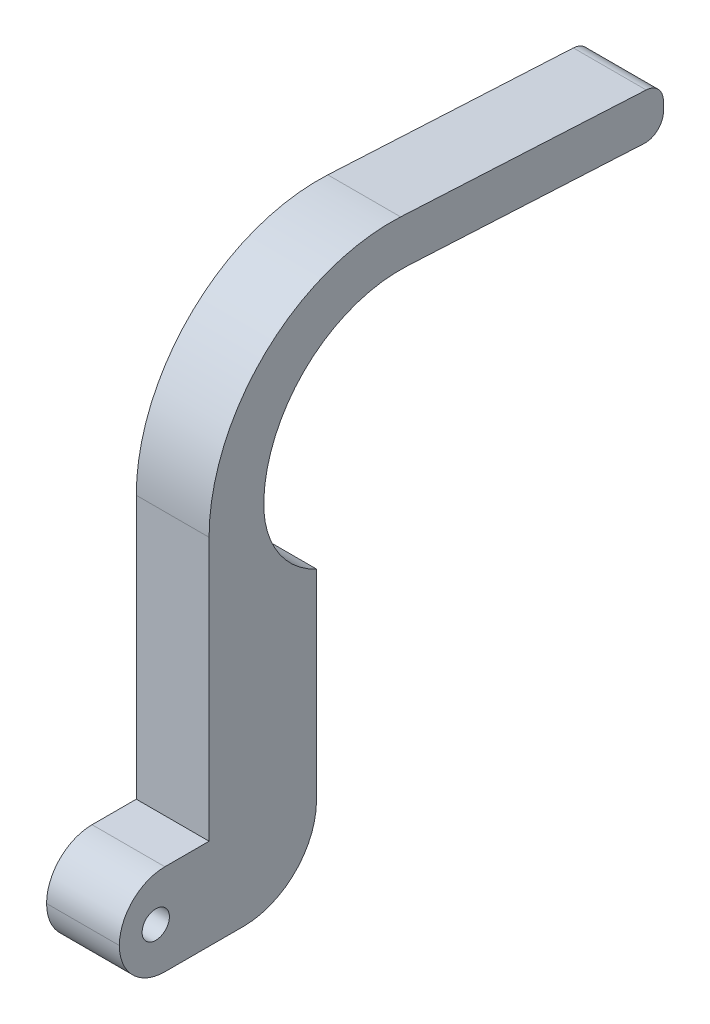
ISO-10303-21;
HEADER;
FILE_DESCRIPTION(('STEP AP214'),'2;1');
FILE_NAME('part.step','',(''),(''),'','','');
FILE_SCHEMA(('AUTOMOTIVE_DESIGN { 1 0 10303 214 1 1 1 1 }'));
ENDSEC;
DATA;
#1=APPLICATION_CONTEXT('core data for automotive mechanical design processes');
#2=APPLICATION_PROTOCOL_DEFINITION('international standard','automotive_design',2000,#1);
#3=PRODUCT_CONTEXT('',#1,'mechanical');
#4=PRODUCT('Part','Part','',(#3));
#5=PRODUCT_RELATED_PRODUCT_CATEGORY('part','',(#4));
#6=PRODUCT_DEFINITION_FORMATION('','',#4);
#7=PRODUCT_DEFINITION_CONTEXT('part definition',#1,'design');
#8=PRODUCT_DEFINITION('design','',#6,#7);
#9=PRODUCT_DEFINITION_SHAPE('','',#8);
#10=(LENGTH_UNIT() NAMED_UNIT(*) SI_UNIT(.MILLI.,.METRE.));
#11=(NAMED_UNIT(*) PLANE_ANGLE_UNIT() SI_UNIT($,.RADIAN.));
#12=(NAMED_UNIT(*) SI_UNIT($,.STERADIAN.) SOLID_ANGLE_UNIT());
#13=UNCERTAINTY_MEASURE_WITH_UNIT(LENGTH_MEASURE(1.E-05),#10,'distance_accuracy_value','');
#14=(GEOMETRIC_REPRESENTATION_CONTEXT(3) GLOBAL_UNCERTAINTY_ASSIGNED_CONTEXT((#13)) GLOBAL_UNIT_ASSIGNED_CONTEXT((#10,
#11,#12)) REPRESENTATION_CONTEXT('',''));
#15=CARTESIAN_POINT('',(0.,0.,0.));
#16=DIRECTION('',(0.,0.,1.));
#17=DIRECTION('',(1.,0.,0.));
#18=AXIS2_PLACEMENT_3D('',#15,#16,#17);
#19=CARTESIAN_POINT('',(8.,-10.,0.));
#20=DIRECTION('',(0.,1.,0.));
#21=DIRECTION('',(0.,0.,1.));
#22=AXIS2_PLACEMENT_3D('',#19,#20,#21);
#23=PLANE('',#22);
#24=DIRECTION('',(0.,0.,-1.));
#25=VECTOR('',#24,1.);
#26=CARTESIAN_POINT('',(0.,-10.,0.));
#27=LINE('',#26,#25);
#28=CARTESIAN_POINT('',(0.,-10.,-5.));
#29=VERTEX_POINT('',#28);
#30=CARTESIAN_POINT('',(0.,-10.,-13.6660245501572));
#31=VERTEX_POINT('',#30);
#32=EDGE_CURVE('E206',#29,#31,#27,.T.);
#33=ORIENTED_EDGE('',*,*,#32,.T.);
#34=DIRECTION('',(-1.,0.,0.));
#35=VECTOR('',#34,1.);
#36=CARTESIAN_POINT('',(8.,-10.,-13.6660245501572));
#37=LINE('',#36,#35);
#38=CARTESIAN_POINT('',(8.,-10.,-13.6660245501572));
#39=VERTEX_POINT('',#38);
#40=EDGE_CURVE('E42',#31,#39,#37,.F.);
#41=ORIENTED_EDGE('',*,*,#40,.T.);
#42=DIRECTION('',(0.,0.,-1.));
#43=VECTOR('',#42,1.);
#44=CARTESIAN_POINT('',(8.,-10.,0.));
#45=LINE('',#44,#43);
#46=CARTESIAN_POINT('',(8.,-10.,-5.));
#47=VERTEX_POINT('',#46);
#48=EDGE_CURVE('E151',#47,#39,#45,.T.);
#49=ORIENTED_EDGE('',*,*,#48,.F.);
#50=DIRECTION('',(-1.,0.,0.));
#51=VECTOR('',#50,1.);
#52=CARTESIAN_POINT('',(8.,-10.,-5.));
#53=LINE('',#52,#51);
#54=EDGE_CURVE('E189',#47,#29,#53,.T.);
#55=ORIENTED_EDGE('',*,*,#54,.T.);
#56=EDGE_LOOP('',(#33,#41,#49,#55));
#57=FACE_BOUND('',#56,.T.);
#58=ADVANCED_FACE('F34',(#57),#23,.F.);
#59=CARTESIAN_POINT('',(8.,-10.,-21.6660245501572));
#60=DIRECTION('',(0.,0.,1.));
#61=DIRECTION('',(1.,0.,0.));
#62=AXIS2_PLACEMENT_3D('',#59,#60,#61);
#63=PLANE('',#62);
#64=DIRECTION('',(0.,1.,0.));
#65=VECTOR('',#64,1.);
#66=CARTESIAN_POINT('',(8.,-10.,-21.6660245501572));
#67=LINE('',#66,#65);
#68=CARTESIAN_POINT('',(8.,-2.,-21.6660245501572));
#69=VERTEX_POINT('',#68);
#70=CARTESIAN_POINT('',(8.,20.,-21.6660245501572));
#71=VERTEX_POINT('',#70);
#72=EDGE_CURVE('E140',#69,#71,#67,.T.);
#73=ORIENTED_EDGE('',*,*,#72,.F.);
#74=DIRECTION('',(-1.,0.,0.));
#75=VECTOR('',#74,1.);
#76=CARTESIAN_POINT('',(8.,-2.,-21.6660245501572));
#77=LINE('',#76,#75);
#78=CARTESIAN_POINT('',(0.,-2.,-21.6660245501572));
#79=VERTEX_POINT('',#78);
#80=EDGE_CURVE('E202',#69,#79,#77,.T.);
#81=ORIENTED_EDGE('',*,*,#80,.T.);
#82=DIRECTION('',(0.,1.,0.));
#83=VECTOR('',#82,1.);
#84=CARTESIAN_POINT('',(0.,-10.,-21.6660245501572));
#85=LINE('',#84,#83);
#86=CARTESIAN_POINT('',(0.,20.,-21.6660245501572));
#87=VERTEX_POINT('',#86);
#88=EDGE_CURVE('E156',#79,#87,#85,.T.);
#89=ORIENTED_EDGE('',*,*,#88,.T.);
#90=DIRECTION('',(-1.,0.,0.));
#91=VECTOR('',#90,1.);
#92=CARTESIAN_POINT('',(8.,20.,-21.6660245501572));
#93=LINE('',#92,#91);
#94=EDGE_CURVE('E154',#71,#87,#93,.T.);
#95=ORIENTED_EDGE('',*,*,#94,.F.);
#96=EDGE_LOOP('',(#73,#81,#89,#95));
#97=FACE_BOUND('',#96,.T.);
#98=ADVANCED_FACE('F155',(#97),#63,.F.);
#99=CARTESIAN_POINT('',(8.,42.3832021878526,-59.7897988305178));
#100=DIRECTION('',(0.,0.998629534754574,-0.0523359562429474));
#101=DIRECTION('',(0.,0.0523359562429474,0.998629534754574));
#102=AXIS2_PLACEMENT_3D('',#99,#100,#101);
#103=PLANE('',#102);
#104=DIRECTION('',(0.,-0.0523359562429474,-0.998629534754574));
#105=VECTOR('',#104,1.);
#106=CARTESIAN_POINT('',(0.,42.3832021878526,-59.7897988305178));
#107=LINE('',#106,#105);
#108=CARTESIAN_POINT('',(0.,43.8582944664058,-31.6433614364333));
#109=VERTEX_POINT('',#108);
#110=CARTESIAN_POINT('',(0.,42.4935033689054,-57.6851269180319));
#111=VERTEX_POINT('',#110);
#112=EDGE_CURVE('E212',#109,#111,#107,.T.);
#113=ORIENTED_EDGE('',*,*,#112,.T.);
#114=DIRECTION('',(-1.,0.,0.));
#115=VECTOR('',#114,1.);
#116=CARTESIAN_POINT('',(8.,42.4935033689054,-57.6851269180319));
#117=LINE('',#116,#115);
#118=CARTESIAN_POINT('',(8.,42.4935033689054,-57.6851269180319));
#119=VERTEX_POINT('',#118);
#120=EDGE_CURVE('E187',#111,#119,#117,.F.);
#121=ORIENTED_EDGE('',*,*,#120,.T.);
#122=DIRECTION('',(0.,-0.0523359562429474,-0.998629534754574));
#123=VECTOR('',#122,1.);
#124=CARTESIAN_POINT('',(8.,42.3832021878526,-59.7897988305178));
#125=LINE('',#124,#123);
#126=CARTESIAN_POINT('',(8.,43.8582944664058,-31.6433614364333));
#127=VERTEX_POINT('',#126);
#128=EDGE_CURVE('E150',#127,#119,#125,.T.);
#129=ORIENTED_EDGE('',*,*,#128,.F.);
#130=DIRECTION('',(-1.,0.,0.));
#131=VECTOR('',#130,1.);
#132=CARTESIAN_POINT('',(0.,43.8582944664058,-31.6433614364333));
#133=LINE('',#132,#131);
#134=EDGE_CURVE('E159',#127,#109,#133,.T.);
#135=ORIENTED_EDGE('',*,*,#134,.T.);
#136=EDGE_LOOP('',(#113,#121,#129,#135));
#137=FACE_BOUND('',#136,.T.);
#138=ADVANCED_FACE('F255',(#137),#103,.F.);
#139=CARTESIAN_POINT('',(8.,47.3832021878526,-59.7897988305178));
#140=DIRECTION('',(0.,0.,1.));
#141=DIRECTION('',(0.,-1.,0.));
#142=AXIS2_PLACEMENT_3D('',#139,#140,#141);
#143=PLANE('',#142);
#144=DIRECTION('',(0.,1.,0.));
#145=VECTOR('',#144,1.);
#146=CARTESIAN_POINT('',(0.,47.3832021878526,-59.7897988305178));
#147=LINE('',#146,#145);
#148=CARTESIAN_POINT('',(0.,44.4907624384146,-59.7897988305178));
#149=VERTEX_POINT('',#148);
#150=CARTESIAN_POINT('',(0.,45.4852730544229,-59.7897988305178));
#151=VERTEX_POINT('',#150);
#152=EDGE_CURVE('E215',#149,#151,#147,.T.);
#153=ORIENTED_EDGE('',*,*,#152,.T.);
#154=DIRECTION('',(-1.,0.,0.));
#155=VECTOR('',#154,1.);
#156=CARTESIAN_POINT('',(8.,45.4852730544229,-59.7897988305178));
#157=LINE('',#156,#155);
#158=CARTESIAN_POINT('',(8.,45.4852730544229,-59.7897988305178));
#159=VERTEX_POINT('',#158);
#160=EDGE_CURVE('E181',#151,#159,#157,.F.);
#161=ORIENTED_EDGE('',*,*,#160,.T.);
#162=DIRECTION('',(0.,1.,0.));
#163=VECTOR('',#162,1.);
#164=CARTESIAN_POINT('',(8.,47.3832021878526,-59.7897988305178));
#165=LINE('',#164,#163);
#166=CARTESIAN_POINT('',(8.,44.4907624384146,-59.7897988305178));
#167=VERTEX_POINT('',#166);
#168=EDGE_CURVE('E264',#167,#159,#165,.T.);
#169=ORIENTED_EDGE('',*,*,#168,.F.);
#170=DIRECTION('',(-1.,0.,0.));
#171=VECTOR('',#170,1.);
#172=CARTESIAN_POINT('',(8.,44.4907624384146,-59.7897988305178));
#173=LINE('',#172,#171);
#174=EDGE_CURVE('E178',#167,#149,#173,.T.);
#175=ORIENTED_EDGE('',*,*,#174,.T.);
#176=EDGE_LOOP('',(#153,#161,#169,#175));
#177=FACE_BOUND('',#176,.T.);
#178=ADVANCED_FACE('F267',(#177),#143,.F.);
#179=CARTESIAN_POINT('',(8.,50.,-9.85832209278914));
#180=DIRECTION('',(0.,-0.998629534754574,0.0523359562429475));
#181=DIRECTION('',(0.,-0.0523359562429475,-0.998629534754574));
#182=AXIS2_PLACEMENT_3D('',#179,#180,#181);
#183=PLANE('',#182);
#184=DIRECTION('',(0.,0.0523359562429475,0.998629534754574));
#185=VECTOR('',#184,1.);
#186=CARTESIAN_POINT('',(8.,50.,-9.85832209278914));
#187=LINE('',#186,#185);
#188=CARTESIAN_POINT('',(8.,47.482532123932,-57.8944707430037));
#189=VERTEX_POINT('',#188);
#190=CARTESIAN_POINT('',(8.,48.8969881894721,-30.9050412176481));
#191=VERTEX_POINT('',#190);
#192=EDGE_CURVE('E269',#189,#191,#187,.T.);
#193=ORIENTED_EDGE('',*,*,#192,.F.);
#194=DIRECTION('',(-1.,0.,0.));
#195=VECTOR('',#194,1.);
#196=CARTESIAN_POINT('',(8.,47.482532123932,-57.8944707430037));
#197=LINE('',#196,#195);
#198=CARTESIAN_POINT('',(0.,47.482532123932,-57.8944707430037));
#199=VERTEX_POINT('',#198);
#200=EDGE_CURVE('E166',#189,#199,#197,.T.);
#201=ORIENTED_EDGE('',*,*,#200,.T.);
#202=DIRECTION('',(0.,0.0523359562429475,0.998629534754574));
#203=VECTOR('',#202,1.);
#204=CARTESIAN_POINT('',(0.,50.,-9.85832209278914));
#205=LINE('',#204,#203);
#206=CARTESIAN_POINT('',(0.,48.8969881894721,-30.9050412176481));
#207=VERTEX_POINT('',#206);
#208=EDGE_CURVE('E222',#199,#207,#205,.T.);
#209=ORIENTED_EDGE('',*,*,#208,.T.);
#210=DIRECTION('',(-1.,0.,0.));
#211=VECTOR('',#210,1.);
#212=CARTESIAN_POINT('',(8.,48.8969881894721,-30.9050412176481));
#213=LINE('',#212,#211);
#214=EDGE_CURVE('E244',#207,#191,#213,.F.);
#215=ORIENTED_EDGE('',*,*,#214,.T.);
#216=EDGE_LOOP('',(#193,#201,#209,#215));
#217=FACE_BOUND('',#216,.T.);
#218=ADVANCED_FACE('F393',(#217),#183,.F.);
#219=CARTESIAN_POINT('',(8.,0.,-9.85832209278914));
#220=DIRECTION('',(0.,0.,-1.));
#221=DIRECTION('',(-1.,0.,0.));
#222=AXIS2_PLACEMENT_3D('',#219,#220,#221);
#223=PLANE('',#222);
#224=DIRECTION('',(0.,-1.,0.));
#225=VECTOR('',#224,1.);
#226=CARTESIAN_POINT('',(8.,0.,-9.85832209278914));
#227=LINE('',#226,#225);
#228=CARTESIAN_POINT('',(8.,28.9243974943807,-9.85832209278914));
#229=VERTEX_POINT('',#228);
#230=CARTESIAN_POINT('',(8.,0.,-9.85832209278914));
#231=VERTEX_POINT('',#230);
#232=EDGE_CURVE('E271',#229,#231,#227,.T.);
#233=ORIENTED_EDGE('',*,*,#232,.F.);
#234=DIRECTION('',(-1.,0.,0.));
#235=VECTOR('',#234,1.);
#236=CARTESIAN_POINT('',(8.,28.9243974943807,-9.85832209278914));
#237=LINE('',#236,#235);
#238=CARTESIAN_POINT('',(0.,28.9243974943807,-9.85832209278914));
#239=VERTEX_POINT('',#238);
#240=EDGE_CURVE('E238',#229,#239,#237,.T.);
#241=ORIENTED_EDGE('',*,*,#240,.T.);
#242=DIRECTION('',(0.,-1.,0.));
#243=VECTOR('',#242,1.);
#244=CARTESIAN_POINT('',(0.,0.,-9.85832209278914));
#245=LINE('',#244,#243);
#246=CARTESIAN_POINT('',(0.,0.,-9.85832209278914));
#247=VERTEX_POINT('',#246);
#248=EDGE_CURVE('E224',#239,#247,#245,.T.);
#249=ORIENTED_EDGE('',*,*,#248,.T.);
#250=DIRECTION('',(-1.,0.,0.));
#251=VECTOR('',#250,1.);
#252=CARTESIAN_POINT('',(8.,0.,-9.85832209278914));
#253=LINE('',#252,#251);
#254=EDGE_CURVE('E160',#231,#247,#253,.T.);
#255=ORIENTED_EDGE('',*,*,#254,.F.);
#256=EDGE_LOOP('',(#233,#241,#249,#255));
#257=FACE_BOUND('',#256,.T.);
#258=ADVANCED_FACE('F313',(#257),#223,.F.);
#259=CARTESIAN_POINT('',(8.,0.,0.));
#260=DIRECTION('',(0.,-1.,0.));
#261=DIRECTION('',(0.,0.,-1.));
#262=AXIS2_PLACEMENT_3D('',#259,#260,#261);
#263=PLANE('',#262);
#264=DIRECTION('',(0.,0.,1.));
#265=VECTOR('',#264,1.);
#266=CARTESIAN_POINT('',(0.,0.,0.));
#267=LINE('',#266,#265);
#268=CARTESIAN_POINT('',(0.,0.,-5.));
#269=VERTEX_POINT('',#268);
#270=EDGE_CURVE('E226',#247,#269,#267,.T.);
#271=ORIENTED_EDGE('',*,*,#270,.T.);
#272=DIRECTION('',(-1.,0.,0.));
#273=VECTOR('',#272,1.);
#274=CARTESIAN_POINT('',(8.,0.,-5.));
#275=LINE('',#274,#273);
#276=CARTESIAN_POINT('',(8.,0.,-5.));
#277=VERTEX_POINT('',#276);
#278=EDGE_CURVE('E200',#269,#277,#275,.F.);
#279=ORIENTED_EDGE('',*,*,#278,.T.);
#280=DIRECTION('',(0.,0.,1.));
#281=VECTOR('',#280,1.);
#282=CARTESIAN_POINT('',(8.,0.,0.));
#283=LINE('',#282,#281);
#284=EDGE_CURVE('E230',#231,#277,#283,.T.);
#285=ORIENTED_EDGE('',*,*,#284,.F.);
#286=ORIENTED_EDGE('',*,*,#254,.T.);
#287=EDGE_LOOP('',(#271,#279,#285,#286));
#288=FACE_BOUND('',#287,.T.);
#289=ADVANCED_FACE('F306',(#288),#263,.F.);
#290=CARTESIAN_POINT('',(8.,0.,0.));
#291=DIRECTION('',(1.,0.,0.));
#292=DIRECTION('',(0.,0.,-1.));
#293=AXIS2_PLACEMENT_3D('',#290,#291,#292);
#294=PLANE('',#293);
#295=CARTESIAN_POINT('',(8.,-5.,-4.));
#296=DIRECTION('',(1.,0.,0.));
#297=DIRECTION('',(0.,0.,-1.));
#298=AXIS2_PLACEMENT_3D('',#295,#296,#297);
#299=CIRCLE('',#298,1.5);
#300=CARTESIAN_POINT('',(8.,-5.,-5.5));
#301=VERTEX_POINT('',#300);
#302=EDGE_CURVE('E292',#301,#301,#299,.T.);
#303=ORIENTED_EDGE('',*,*,#302,.F.);
#304=EDGE_LOOP('',(#303));
#305=FACE_BOUND('',#304,.T.);
#306=ORIENTED_EDGE('',*,*,#48,.T.);
#307=CARTESIAN_POINT('',(8.,-2.,-13.6660245501572));
#308=DIRECTION('',(1.,0.,0.));
#309=DIRECTION('',(0.,0.,-1.));
#310=AXIS2_PLACEMENT_3D('',#307,#308,#309);
#311=CIRCLE('',#310,8.);
#312=EDGE_CURVE('E11',#39,#69,#311,.T.);
#313=ORIENTED_EDGE('',*,*,#312,.T.);
#314=ORIENTED_EDGE('',*,*,#72,.T.);
#315=CARTESIAN_POINT('',(8.,29.0769872147264,-25.862249413495));
#316=DIRECTION('',(1.,0.,0.));
#317=DIRECTION('',(0.,0.,-1.));
#318=AXIS2_PLACEMENT_3D('',#315,#316,#317);
#319=CIRCLE('',#318,10.);
#320=CARTESIAN_POINT('',(8.,29.4732587540046,-15.8701040549067));
#321=VERTEX_POINT('',#320);
#322=EDGE_CURVE('E144',#71,#321,#319,.F.);
#323=ORIENTED_EDGE('',*,*,#322,.T.);
#324=CARTESIAN_POINT('',(8.,28.8788514450872,-30.8583220927891));
#325=DIRECTION('',(1.,0.,0.));
#326=DIRECTION('',(0.,0.,-1.));
#327=AXIS2_PLACEMENT_3D('',#324,#325,#326);
#328=CIRCLE('',#327,15.);
#329=EDGE_CURVE('E236',#321,#127,#328,.F.);
#330=ORIENTED_EDGE('',*,*,#329,.T.);
#331=ORIENTED_EDGE('',*,*,#128,.T.);
#332=CARTESIAN_POINT('',(8.,44.4907624384146,-57.7897988305178));
#333=DIRECTION('',(1.,0.,0.));
#334=DIRECTION('',(0.,0.,-1.));
#335=AXIS2_PLACEMENT_3D('',#332,#333,#334);
#336=CIRCLE('',#335,2.);
#337=EDGE_CURVE('E183',#119,#167,#336,.T.);
#338=ORIENTED_EDGE('',*,*,#337,.T.);
#339=ORIENTED_EDGE('',*,*,#168,.T.);
#340=CARTESIAN_POINT('',(8.,45.4852730544229,-57.7897988305178));
#341=DIRECTION('',(1.,0.,0.));
#342=DIRECTION('',(0.,0.,-1.));
#343=AXIS2_PLACEMENT_3D('',#340,#341,#342);
#344=CIRCLE('',#343,2.);
#345=EDGE_CURVE('E185',#159,#189,#344,.T.);
#346=ORIENTED_EDGE('',*,*,#345,.T.);
#347=ORIENTED_EDGE('',*,*,#192,.T.);
#348=CARTESIAN_POINT('',(8.,28.9243974943807,-29.8583220927891));
#349=DIRECTION('',(1.,0.,0.));
#350=DIRECTION('',(0.,0.,-1.));
#351=AXIS2_PLACEMENT_3D('',#348,#349,#350);
#352=CIRCLE('',#351,20.);
#353=EDGE_CURVE('E247',#191,#229,#352,.T.);
#354=ORIENTED_EDGE('',*,*,#353,.T.);
#355=ORIENTED_EDGE('',*,*,#232,.T.);
#356=ORIENTED_EDGE('',*,*,#284,.T.);
#357=CARTESIAN_POINT('',(8.,-5.,-5.));
#358=DIRECTION('',(1.,0.,0.));
#359=DIRECTION('',(0.,0.,-1.));
#360=AXIS2_PLACEMENT_3D('',#357,#358,#359);
#361=CIRCLE('',#360,5.);
#362=CARTESIAN_POINT('',(8.,-5.,0.));
#363=VERTEX_POINT('',#362);
#364=EDGE_CURVE('E196',#277,#363,#361,.T.);
#365=ORIENTED_EDGE('',*,*,#364,.T.);
#366=CARTESIAN_POINT('',(8.,-5.,-5.));
#367=DIRECTION('',(1.,0.,0.));
#368=DIRECTION('',(0.,0.,-1.));
#369=AXIS2_PLACEMENT_3D('',#366,#367,#368);
#370=CIRCLE('',#369,5.);
#371=EDGE_CURVE('E198',#363,#47,#370,.T.);
#372=ORIENTED_EDGE('',*,*,#371,.T.);
#373=EDGE_LOOP('',(#306,#313,#314,#323,#330,#331,#338,#339,#346,#347,#354,#355,#356,#365,#372));
#374=FACE_BOUND('',#373,.T.);
#375=ADVANCED_FACE('F142',(#305,#374),#294,.T.);
#376=CARTESIAN_POINT('',(0.,0.,0.));
#377=DIRECTION('',(1.,0.,0.));
#378=DIRECTION('',(0.,0.,-1.));
#379=AXIS2_PLACEMENT_3D('',#376,#377,#378);
#380=PLANE('',#379);
#381=CARTESIAN_POINT('',(0.,-5.,-4.));
#382=DIRECTION('',(1.,0.,0.));
#383=DIRECTION('',(0.,0.,-1.));
#384=AXIS2_PLACEMENT_3D('',#381,#382,#383);
#385=CIRCLE('',#384,1.5);
#386=CARTESIAN_POINT('',(0.,-5.,-5.5));
#387=VERTEX_POINT('',#386);
#388=EDGE_CURVE('E207',#387,#387,#385,.T.);
#389=ORIENTED_EDGE('',*,*,#388,.T.);
#390=EDGE_LOOP('',(#389));
#391=FACE_BOUND('',#390,.T.);
#392=ORIENTED_EDGE('',*,*,#88,.F.);
#393=CARTESIAN_POINT('',(0.,-2.,-13.6660245501572));
#394=DIRECTION('',(1.,0.,0.));
#395=DIRECTION('',(0.,0.,-1.));
#396=AXIS2_PLACEMENT_3D('',#393,#394,#395);
#397=CIRCLE('',#396,8.);
#398=EDGE_CURVE('E56',#79,#31,#397,.F.);
#399=ORIENTED_EDGE('',*,*,#398,.T.);
#400=ORIENTED_EDGE('',*,*,#32,.F.);
#401=CARTESIAN_POINT('',(0.,-5.,-5.));
#402=DIRECTION('',(1.,0.,0.));
#403=DIRECTION('',(0.,0.,-1.));
#404=AXIS2_PLACEMENT_3D('',#401,#402,#403);
#405=CIRCLE('',#404,5.);
#406=CARTESIAN_POINT('',(0.,-5.,0.));
#407=VERTEX_POINT('',#406);
#408=EDGE_CURVE('E194',#29,#407,#405,.F.);
#409=ORIENTED_EDGE('',*,*,#408,.T.);
#410=CARTESIAN_POINT('',(0.,-5.,-5.));
#411=DIRECTION('',(1.,0.,0.));
#412=DIRECTION('',(0.,0.,-1.));
#413=AXIS2_PLACEMENT_3D('',#410,#411,#412);
#414=CIRCLE('',#413,5.);
#415=EDGE_CURVE('E192',#407,#269,#414,.F.);
#416=ORIENTED_EDGE('',*,*,#415,.T.);
#417=ORIENTED_EDGE('',*,*,#270,.F.);
#418=ORIENTED_EDGE('',*,*,#248,.F.);
#419=CARTESIAN_POINT('',(0.,28.9243974943807,-29.8583220927891));
#420=DIRECTION('',(1.,0.,0.));
#421=DIRECTION('',(0.,0.,-1.));
#422=AXIS2_PLACEMENT_3D('',#419,#420,#421);
#423=CIRCLE('',#422,20.);
#424=EDGE_CURVE('E241',#239,#207,#423,.F.);
#425=ORIENTED_EDGE('',*,*,#424,.T.);
#426=ORIENTED_EDGE('',*,*,#208,.F.);
#427=CARTESIAN_POINT('',(0.,45.4852730544229,-57.7897988305178));
#428=DIRECTION('',(1.,0.,0.));
#429=DIRECTION('',(0.,0.,-1.));
#430=AXIS2_PLACEMENT_3D('',#427,#428,#429);
#431=CIRCLE('',#430,2.);
#432=EDGE_CURVE('E176',#199,#151,#431,.F.);
#433=ORIENTED_EDGE('',*,*,#432,.T.);
#434=ORIENTED_EDGE('',*,*,#152,.F.);
#435=CARTESIAN_POINT('',(0.,44.4907624384146,-57.7897988305178));
#436=DIRECTION('',(1.,0.,0.));
#437=DIRECTION('',(0.,0.,-1.));
#438=AXIS2_PLACEMENT_3D('',#435,#436,#437);
#439=CIRCLE('',#438,2.);
#440=EDGE_CURVE('E170',#149,#111,#439,.F.);
#441=ORIENTED_EDGE('',*,*,#440,.T.);
#442=ORIENTED_EDGE('',*,*,#112,.F.);
#443=CARTESIAN_POINT('',(0.,28.8788514450872,-30.8583220927891));
#444=DIRECTION('',(1.,0.,0.));
#445=DIRECTION('',(0.,0.,-1.));
#446=AXIS2_PLACEMENT_3D('',#443,#444,#445);
#447=CIRCLE('',#446,15.);
#448=CARTESIAN_POINT('',(0.,29.4732587540046,-15.8701040549067));
#449=VERTEX_POINT('',#448);
#450=EDGE_CURVE('E234',#109,#449,#447,.T.);
#451=ORIENTED_EDGE('',*,*,#450,.T.);
#452=CARTESIAN_POINT('',(0.,29.0769872147264,-25.862249413495));
#453=DIRECTION('',(1.,0.,0.));
#454=DIRECTION('',(0.,0.,-1.));
#455=AXIS2_PLACEMENT_3D('',#452,#453,#454);
#456=CIRCLE('',#455,10.);
#457=EDGE_CURVE('E167',#449,#87,#456,.T.);
#458=ORIENTED_EDGE('',*,*,#457,.T.);
#459=EDGE_LOOP('',(#392,#399,#400,#409,#416,#417,#418,#425,#426,#433,#434,#441,#442,#451,#458));
#460=FACE_BOUND('',#459,.T.);
#461=ADVANCED_FACE('F210',(#391,#460),#380,.F.);
#462=CARTESIAN_POINT('',(8.,28.8788514450872,-30.8583220927891));
#463=DIRECTION('',(1.,0.,0.));
#464=DIRECTION('',(0.,0.,-1.));
#465=AXIS2_PLACEMENT_3D('',#462,#463,#464);
#466=CYLINDRICAL_SURFACE('',#465,15.);
#467=ORIENTED_EDGE('',*,*,#329,.F.);
#468=DIRECTION('',(1.,0.,0.));
#469=VECTOR('',#468,1.);
#470=CARTESIAN_POINT('',(8.,29.4732587540046,-15.8701040549067));
#471=LINE('',#470,#469);
#472=EDGE_CURVE('E165',#321,#449,#471,.F.);
#473=ORIENTED_EDGE('',*,*,#472,.T.);
#474=ORIENTED_EDGE('',*,*,#450,.F.);
#475=ORIENTED_EDGE('',*,*,#134,.F.);
#476=EDGE_LOOP('',(#467,#473,#474,#475));
#477=FACE_BOUND('',#476,.T.);
#478=ADVANCED_FACE('F249',(#477),#466,.F.);
#479=CARTESIAN_POINT('',(8.,28.9243974943807,-29.8583220927891));
#480=DIRECTION('',(-1.,0.,0.));
#481=DIRECTION('',(0.,0.,1.));
#482=AXIS2_PLACEMENT_3D('',#479,#480,#481);
#483=CYLINDRICAL_SURFACE('',#482,20.);
#484=ORIENTED_EDGE('',*,*,#353,.F.);
#485=ORIENTED_EDGE('',*,*,#214,.F.);
#486=ORIENTED_EDGE('',*,*,#424,.F.);
#487=ORIENTED_EDGE('',*,*,#240,.F.);
#488=EDGE_LOOP('',(#484,#485,#486,#487));
#489=FACE_BOUND('',#488,.T.);
#490=ADVANCED_FACE('F325',(#489),#483,.T.);
#491=CARTESIAN_POINT('',(8.,29.0769872147264,-25.862249413495));
#492=DIRECTION('',(-1.,0.,0.));
#493=DIRECTION('',(0.,0.,1.));
#494=AXIS2_PLACEMENT_3D('',#491,#492,#493);
#495=CYLINDRICAL_SURFACE('',#494,10.);
#496=ORIENTED_EDGE('',*,*,#322,.F.);
#497=ORIENTED_EDGE('',*,*,#94,.T.);
#498=ORIENTED_EDGE('',*,*,#457,.F.);
#499=ORIENTED_EDGE('',*,*,#472,.F.);
#500=EDGE_LOOP('',(#496,#497,#498,#499));
#501=FACE_BOUND('',#500,.T.);
#502=ADVANCED_FACE('F163',(#501),#495,.F.);
#503=CARTESIAN_POINT('',(8.,45.4852730544229,-57.7897988305178));
#504=DIRECTION('',(-1.,0.,0.));
#505=DIRECTION('',(0.,0.,1.));
#506=AXIS2_PLACEMENT_3D('',#503,#504,#505);
#507=CYLINDRICAL_SURFACE('',#506,2.);
#508=ORIENTED_EDGE('',*,*,#345,.F.);
#509=ORIENTED_EDGE('',*,*,#160,.F.);
#510=ORIENTED_EDGE('',*,*,#432,.F.);
#511=ORIENTED_EDGE('',*,*,#200,.F.);
#512=EDGE_LOOP('',(#508,#509,#510,#511));
#513=FACE_BOUND('',#512,.T.);
#514=ADVANCED_FACE('F331',(#513),#507,.T.);
#515=CARTESIAN_POINT('',(8.,44.4907624384146,-57.7897988305178));
#516=DIRECTION('',(-1.,0.,0.));
#517=DIRECTION('',(0.,0.,1.));
#518=AXIS2_PLACEMENT_3D('',#515,#516,#517);
#519=CYLINDRICAL_SURFACE('',#518,2.);
#520=ORIENTED_EDGE('',*,*,#337,.F.);
#521=ORIENTED_EDGE('',*,*,#120,.F.);
#522=ORIENTED_EDGE('',*,*,#440,.F.);
#523=ORIENTED_EDGE('',*,*,#174,.F.);
#524=EDGE_LOOP('',(#520,#521,#522,#523));
#525=FACE_BOUND('',#524,.T.);
#526=ADVANCED_FACE('F260',(#525),#519,.T.);
#527=CARTESIAN_POINT('',(8.,-5.,-5.));
#528=DIRECTION('',(-1.,0.,0.));
#529=DIRECTION('',(0.,0.,1.));
#530=AXIS2_PLACEMENT_3D('',#527,#528,#529);
#531=CYLINDRICAL_SURFACE('',#530,5.);
#532=DIRECTION('',(-1.,0.,0.));
#533=VECTOR('',#532,1.);
#534=CARTESIAN_POINT('',(8.,-5.,0.));
#535=LINE('',#534,#533);
#536=EDGE_CURVE('E203',#363,#407,#535,.T.);
#537=ORIENTED_EDGE('',*,*,#536,.F.);
#538=ORIENTED_EDGE('',*,*,#364,.F.);
#539=ORIENTED_EDGE('',*,*,#278,.F.);
#540=ORIENTED_EDGE('',*,*,#415,.F.);
#541=EDGE_LOOP('',(#537,#538,#539,#540));
#542=FACE_BOUND('',#541,.T.);
#543=ADVANCED_FACE('F284',(#542),#531,.T.);
#544=CARTESIAN_POINT('',(8.,-5.,-5.));
#545=DIRECTION('',(-1.,0.,0.));
#546=DIRECTION('',(0.,0.,1.));
#547=AXIS2_PLACEMENT_3D('',#544,#545,#546);
#548=CYLINDRICAL_SURFACE('',#547,5.);
#549=ORIENTED_EDGE('',*,*,#371,.F.);
#550=ORIENTED_EDGE('',*,*,#536,.T.);
#551=ORIENTED_EDGE('',*,*,#408,.F.);
#552=ORIENTED_EDGE('',*,*,#54,.F.);
#553=EDGE_LOOP('',(#549,#550,#551,#552));
#554=FACE_BOUND('',#553,.T.);
#555=ADVANCED_FACE('F289',(#554),#548,.T.);
#556=CARTESIAN_POINT('',(0.,-5.,-4.));
#557=DIRECTION('',(1.,0.,0.));
#558=DIRECTION('',(0.,0.,-1.));
#559=AXIS2_PLACEMENT_3D('',#556,#557,#558);
#560=CYLINDRICAL_SURFACE('',#559,1.5);
#561=ORIENTED_EDGE('',*,*,#388,.F.);
#562=EDGE_LOOP('',(#561));
#563=FACE_BOUND('',#562,.T.);
#564=ORIENTED_EDGE('',*,*,#302,.T.);
#565=EDGE_LOOP('',(#564));
#566=FACE_BOUND('',#565,.T.);
#567=ADVANCED_FACE('F299',(#563,#566),#560,.F.);
#568=CARTESIAN_POINT('',(8.,-2.,-13.6660245501572));
#569=DIRECTION('',(-1.,0.,0.));
#570=DIRECTION('',(0.,0.,1.));
#571=AXIS2_PLACEMENT_3D('',#568,#569,#570);
#572=CYLINDRICAL_SURFACE('',#571,8.);
#573=ORIENTED_EDGE('',*,*,#312,.F.);
#574=ORIENTED_EDGE('',*,*,#40,.F.);
#575=ORIENTED_EDGE('',*,*,#398,.F.);
#576=ORIENTED_EDGE('',*,*,#80,.F.);
#577=EDGE_LOOP('',(#573,#574,#575,#576));
#578=FACE_BOUND('',#577,.T.);
#579=ADVANCED_FACE('F36',(#578),#572,.T.);
#580=CLOSED_SHELL('',(#58,#98,#138,#178,#218,#258,#289,#375,#461,#478,#490,#502,#514,#526,#543,
#555,#567,#579));
#581=MANIFOLD_SOLID_BREP('B2',#580);
#582=ADVANCED_BREP_SHAPE_REPRESENTATION('',(#18,#581),#14);
#583=SHAPE_DEFINITION_REPRESENTATION(#9,#582);
ENDSEC;
END-ISO-10303-21;
